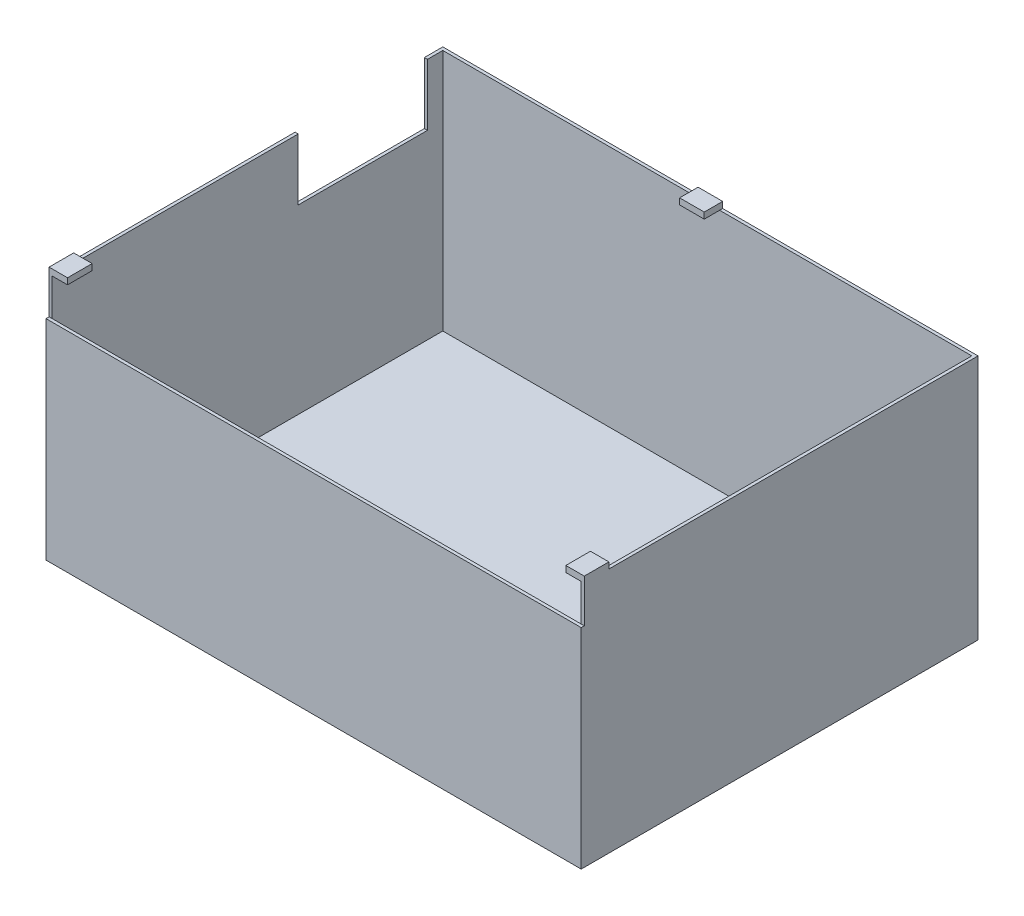
ISO-10303-21;
HEADER;
FILE_DESCRIPTION(('STEP AP214'),'2;1');
FILE_NAME('part.step','',(''),(''),'','','');
FILE_SCHEMA(('AUTOMOTIVE_DESIGN { 1 0 10303 214 1 1 1 1 }'));
ENDSEC;
DATA;
#1=APPLICATION_CONTEXT('core data for automotive mechanical design processes');
#2=APPLICATION_PROTOCOL_DEFINITION('international standard','automotive_design',2000,#1);
#3=PRODUCT_CONTEXT('',#1,'mechanical');
#4=PRODUCT('Part','Part','',(#3));
#5=PRODUCT_RELATED_PRODUCT_CATEGORY('part','',(#4));
#6=PRODUCT_DEFINITION_FORMATION('','',#4);
#7=PRODUCT_DEFINITION_CONTEXT('part definition',#1,'design');
#8=PRODUCT_DEFINITION('design','',#6,#7);
#9=PRODUCT_DEFINITION_SHAPE('','',#8);
#10=(LENGTH_UNIT() NAMED_UNIT(*) SI_UNIT(.MILLI.,.METRE.));
#11=(NAMED_UNIT(*) PLANE_ANGLE_UNIT() SI_UNIT($,.RADIAN.));
#12=(NAMED_UNIT(*) SI_UNIT($,.STERADIAN.) SOLID_ANGLE_UNIT());
#13=UNCERTAINTY_MEASURE_WITH_UNIT(LENGTH_MEASURE(1.E-05),#10,'distance_accuracy_value','');
#14=(GEOMETRIC_REPRESENTATION_CONTEXT(3) GLOBAL_UNCERTAINTY_ASSIGNED_CONTEXT((#13)) GLOBAL_UNIT_ASSIGNED_CONTEXT((#10,
#11,#12)) REPRESENTATION_CONTEXT('',''));
#15=CARTESIAN_POINT('',(0.,0.,0.));
#16=DIRECTION('',(0.,0.,1.));
#17=DIRECTION('',(1.,0.,0.));
#18=AXIS2_PLACEMENT_3D('',#15,#16,#17);
#19=CARTESIAN_POINT('',(0.,80.,0.));
#20=DIRECTION('',(0.,1.,0.));
#21=DIRECTION('',(0.,0.,1.));
#22=AXIS2_PLACEMENT_3D('',#19,#20,#21);
#23=PLANE('',#22);
#24=DIRECTION('',(-1.,0.,0.));
#25=VECTOR('',#24,1.);
#26=CARTESIAN_POINT('',(9.,80.,-122.));
#27=LINE('',#26,#25);
#28=CARTESIAN_POINT('',(0.,80.,-122.));
#29=VERTEX_POINT('',#28);
#30=CARTESIAN_POINT('',(-1.,80.,-122.));
#31=VERTEX_POINT('',#30);
#32=EDGE_CURVE('E236',#29,#31,#27,.T.);
#33=ORIENTED_EDGE('',*,*,#32,.F.);
#34=DIRECTION('',(0.,0.,-1.));
#35=VECTOR('',#34,1.);
#36=CARTESIAN_POINT('',(0.,80.,0.));
#37=LINE('',#36,#35);
#38=CARTESIAN_POINT('',(0.,80.,-127.));
#39=VERTEX_POINT('',#38);
#40=EDGE_CURVE('E369',#29,#39,#37,.T.);
#41=ORIENTED_EDGE('',*,*,#40,.T.);
#42=DIRECTION('',(1.,0.,0.));
#43=VECTOR('',#42,1.);
#44=CARTESIAN_POINT('',(0.,80.,-127.));
#45=LINE('',#44,#43);
#46=CARTESIAN_POINT('',(82.,80.,-127.));
#47=VERTEX_POINT('',#46);
#48=EDGE_CURVE('E375',#39,#47,#45,.T.);
#49=ORIENTED_EDGE('',*,*,#48,.T.);
#50=DIRECTION('',(0.,0.,1.));
#51=VECTOR('',#50,1.);
#52=CARTESIAN_POINT('',(82.,80.,-128.));
#53=LINE('',#52,#51);
#54=CARTESIAN_POINT('',(82.,80.,-128.));
#55=VERTEX_POINT('',#54);
#56=EDGE_CURVE('E270',#55,#47,#53,.T.);
#57=ORIENTED_EDGE('',*,*,#56,.F.);
#58=DIRECTION('',(1.,0.,0.));
#59=VECTOR('',#58,1.);
#60=CARTESIAN_POINT('',(0.,80.,-128.));
#61=LINE('',#60,#59);
#62=CARTESIAN_POINT('',(-1.,80.,-128.));
#63=VERTEX_POINT('',#62);
#64=EDGE_CURVE('E363',#63,#55,#61,.T.);
#65=ORIENTED_EDGE('',*,*,#64,.F.);
#66=DIRECTION('',(0.,0.,-1.));
#67=VECTOR('',#66,1.);
#68=CARTESIAN_POINT('',(-1.,80.,0.));
#69=LINE('',#68,#67);
#70=EDGE_CURVE('E366',#31,#63,#69,.T.);
#71=ORIENTED_EDGE('',*,*,#70,.F.);
#72=EDGE_LOOP('',(#33,#41,#49,#57,#65,#71));
#73=FACE_BOUND('',#72,.T.);
#74=ADVANCED_FACE('F43',(#73),#23,.T.);
#75=DIRECTION('',(-1.,0.,0.));
#76=VECTOR('',#75,1.);
#77=CARTESIAN_POINT('',(9.,80.,-80.));
#78=LINE('',#77,#76);
#79=CARTESIAN_POINT('',(0.,80.,-80.));
#80=VERTEX_POINT('',#79);
#81=CARTESIAN_POINT('',(-1.,80.,-80.));
#82=VERTEX_POINT('',#81);
#83=EDGE_CURVE('E247',#80,#82,#78,.T.);
#84=ORIENTED_EDGE('',*,*,#83,.T.);
#85=CARTESIAN_POINT('',(-1.,80.,-8.));
#86=VERTEX_POINT('',#85);
#87=EDGE_CURVE('E367',#86,#82,#69,.T.);
#88=ORIENTED_EDGE('',*,*,#87,.F.);
#89=DIRECTION('',(-1.,0.,0.));
#90=VECTOR('',#89,1.);
#91=CARTESIAN_POINT('',(-1.,80.,-8.));
#92=LINE('',#91,#90);
#93=CARTESIAN_POINT('',(0.,80.,-8.));
#94=VERTEX_POINT('',#93);
#95=EDGE_CURVE('E326',#94,#86,#92,.T.);
#96=ORIENTED_EDGE('',*,*,#95,.F.);
#97=EDGE_CURVE('E374',#94,#80,#37,.T.);
#98=ORIENTED_EDGE('',*,*,#97,.T.);
#99=EDGE_LOOP('',(#84,#88,#96,#98));
#100=FACE_BOUND('',#99,.T.);
#101=ADVANCED_FACE('F430',(#100),#23,.T.);
#102=CARTESIAN_POINT('',(90.,80.,-128.));
#103=VERTEX_POINT('',#102);
#104=CARTESIAN_POINT('',(173.,80.,-128.));
#105=VERTEX_POINT('',#104);
#106=EDGE_CURVE('E66',#103,#105,#61,.T.);
#107=ORIENTED_EDGE('',*,*,#106,.F.);
#108=DIRECTION('',(0.,0.,-1.));
#109=VECTOR('',#108,1.);
#110=CARTESIAN_POINT('',(90.,80.,-128.));
#111=LINE('',#110,#109);
#112=CARTESIAN_POINT('',(90.,80.,-127.));
#113=VERTEX_POINT('',#112);
#114=EDGE_CURVE('E267',#113,#103,#111,.T.);
#115=ORIENTED_EDGE('',*,*,#114,.F.);
#116=CARTESIAN_POINT('',(172.,80.,-127.));
#117=VERTEX_POINT('',#116);
#118=EDGE_CURVE('E373',#113,#117,#45,.T.);
#119=ORIENTED_EDGE('',*,*,#118,.T.);
#120=DIRECTION('',(0.,0.,-1.));
#121=VECTOR('',#120,1.);
#122=CARTESIAN_POINT('',(172.,80.,0.));
#123=LINE('',#122,#121);
#124=CARTESIAN_POINT('',(172.,80.,-8.));
#125=VERTEX_POINT('',#124);
#126=EDGE_CURVE('E361',#125,#117,#123,.T.);
#127=ORIENTED_EDGE('',*,*,#126,.F.);
#128=DIRECTION('',(-1.,0.,0.));
#129=VECTOR('',#128,1.);
#130=CARTESIAN_POINT('',(173.,80.,-8.));
#131=LINE('',#130,#129);
#132=CARTESIAN_POINT('',(173.,80.,-8.));
#133=VERTEX_POINT('',#132);
#134=EDGE_CURVE('E298',#133,#125,#131,.T.);
#135=ORIENTED_EDGE('',*,*,#134,.F.);
#136=DIRECTION('',(0.,0.,-1.));
#137=VECTOR('',#136,1.);
#138=CARTESIAN_POINT('',(173.,80.,0.));
#139=LINE('',#138,#137);
#140=EDGE_CURVE('E360',#133,#105,#139,.T.);
#141=ORIENTED_EDGE('',*,*,#140,.T.);
#142=EDGE_LOOP('',(#107,#115,#119,#127,#135,#141));
#143=FACE_BOUND('',#142,.T.);
#144=ADVANCED_FACE('F446',(#143),#23,.T.);
#145=CARTESIAN_POINT('',(0.,1.,0.));
#146=DIRECTION('',(0.,0.,-1.));
#147=DIRECTION('',(-1.,0.,0.));
#148=AXIS2_PLACEMENT_3D('',#145,#146,#147);
#149=PLANE('',#148);
#150=DIRECTION('',(0.,-1.,0.));
#151=VECTOR('',#150,1.);
#152=CARTESIAN_POINT('',(-1.,80.,0.));
#153=LINE('',#152,#151);
#154=CARTESIAN_POINT('',(-1.,82.,0.));
#155=VERTEX_POINT('',#154);
#156=CARTESIAN_POINT('',(-1.,68.,0.));
#157=VERTEX_POINT('',#156);
#158=EDGE_CURVE('E397',#155,#157,#153,.T.);
#159=ORIENTED_EDGE('',*,*,#158,.T.);
#160=DIRECTION('',(1.,0.,0.));
#161=VECTOR('',#160,1.);
#162=CARTESIAN_POINT('',(0.,68.,0.));
#163=LINE('',#162,#161);
#164=CARTESIAN_POINT('',(0.,68.,0.));
#165=VERTEX_POINT('',#164);
#166=EDGE_CURVE('E336',#157,#165,#163,.T.);
#167=ORIENTED_EDGE('',*,*,#166,.T.);
#168=DIRECTION('',(0.,-1.,0.));
#169=VECTOR('',#168,1.);
#170=CARTESIAN_POINT('',(0.,80.,0.));
#171=LINE('',#170,#169);
#172=CARTESIAN_POINT('',(0.,80.,0.));
#173=VERTEX_POINT('',#172);
#174=EDGE_CURVE('E394',#173,#165,#171,.T.);
#175=ORIENTED_EDGE('',*,*,#174,.F.);
#176=DIRECTION('',(1.,0.,0.));
#177=VECTOR('',#176,1.);
#178=CARTESIAN_POINT('',(-1.,80.,0.));
#179=LINE('',#178,#177);
#180=CARTESIAN_POINT('',(5.,80.,0.));
#181=VERTEX_POINT('',#180);
#182=EDGE_CURVE('E301',#173,#181,#179,.T.);
#183=ORIENTED_EDGE('',*,*,#182,.T.);
#184=DIRECTION('',(0.,-1.,0.));
#185=VECTOR('',#184,1.);
#186=CARTESIAN_POINT('',(5.,82.,0.));
#187=LINE('',#186,#185);
#188=CARTESIAN_POINT('',(5.,82.,0.));
#189=VERTEX_POINT('',#188);
#190=EDGE_CURVE('E332',#189,#181,#187,.T.);
#191=ORIENTED_EDGE('',*,*,#190,.F.);
#192=DIRECTION('',(1.,0.,0.));
#193=VECTOR('',#192,1.);
#194=CARTESIAN_POINT('',(-1.,82.,0.));
#195=LINE('',#194,#193);
#196=EDGE_CURVE('E313',#155,#189,#195,.T.);
#197=ORIENTED_EDGE('',*,*,#196,.F.);
#198=EDGE_LOOP('',(#159,#167,#175,#183,#191,#197));
#199=FACE_BOUND('',#198,.T.);
#200=ADVANCED_FACE('F519',(#199),#149,.F.);
#201=DIRECTION('',(0.,-1.,0.));
#202=VECTOR('',#201,1.);
#203=CARTESIAN_POINT('',(172.,80.,0.));
#204=LINE('',#203,#202);
#205=CARTESIAN_POINT('',(172.,80.,0.));
#206=VERTEX_POINT('',#205);
#207=CARTESIAN_POINT('',(172.,68.,0.));
#208=VERTEX_POINT('',#207);
#209=EDGE_CURVE('E408',#206,#208,#204,.T.);
#210=ORIENTED_EDGE('',*,*,#209,.T.);
#211=CARTESIAN_POINT('',(173.,68.,0.));
#212=VERTEX_POINT('',#211);
#213=EDGE_CURVE('E341',#208,#212,#163,.T.);
#214=ORIENTED_EDGE('',*,*,#213,.T.);
#215=DIRECTION('',(0.,-1.,0.));
#216=VECTOR('',#215,1.);
#217=CARTESIAN_POINT('',(173.,80.,0.));
#218=LINE('',#217,#216);
#219=CARTESIAN_POINT('',(173.,82.,0.));
#220=VERTEX_POINT('',#219);
#221=EDGE_CURVE('E404',#220,#212,#218,.T.);
#222=ORIENTED_EDGE('',*,*,#221,.F.);
#223=DIRECTION('',(1.,0.,0.));
#224=VECTOR('',#223,1.);
#225=CARTESIAN_POINT('',(173.,82.,0.));
#226=LINE('',#225,#224);
#227=CARTESIAN_POINT('',(167.,82.,0.));
#228=VERTEX_POINT('',#227);
#229=EDGE_CURVE('E290',#228,#220,#226,.T.);
#230=ORIENTED_EDGE('',*,*,#229,.F.);
#231=DIRECTION('',(0.,-1.,0.));
#232=VECTOR('',#231,1.);
#233=CARTESIAN_POINT('',(167.,82.,0.));
#234=LINE('',#233,#232);
#235=CARTESIAN_POINT('',(167.,80.,0.));
#236=VERTEX_POINT('',#235);
#237=EDGE_CURVE('E287',#228,#236,#234,.T.);
#238=ORIENTED_EDGE('',*,*,#237,.T.);
#239=DIRECTION('',(1.,0.,0.));
#240=VECTOR('',#239,1.);
#241=CARTESIAN_POINT('',(173.,80.,0.));
#242=LINE('',#241,#240);
#243=EDGE_CURVE('E291',#236,#206,#242,.T.);
#244=ORIENTED_EDGE('',*,*,#243,.T.);
#245=EDGE_LOOP('',(#210,#214,#222,#230,#238,#244));
#246=FACE_BOUND('',#245,.T.);
#247=ADVANCED_FACE('F45',(#246),#149,.F.);
#248=CARTESIAN_POINT('',(0.,1.,0.));
#249=DIRECTION('',(0.,1.,0.));
#250=DIRECTION('',(0.,0.,1.));
#251=AXIS2_PLACEMENT_3D('',#248,#249,#250);
#252=PLANE('',#251);
#253=DIRECTION('',(1.,0.,0.));
#254=VECTOR('',#253,1.);
#255=CARTESIAN_POINT('',(0.,1.,0.));
#256=LINE('',#255,#254);
#257=CARTESIAN_POINT('',(0.,1.,0.));
#258=VERTEX_POINT('',#257);
#259=CARTESIAN_POINT('',(172.,1.,0.));
#260=VERTEX_POINT('',#259);
#261=EDGE_CURVE('E411',#258,#260,#256,.T.);
#262=ORIENTED_EDGE('',*,*,#261,.T.);
#263=DIRECTION('',(0.,0.,-1.));
#264=VECTOR('',#263,1.);
#265=CARTESIAN_POINT('',(172.,1.,0.));
#266=LINE('',#265,#264);
#267=CARTESIAN_POINT('',(172.,1.,-127.));
#268=VERTEX_POINT('',#267);
#269=EDGE_CURVE('E414',#260,#268,#266,.T.);
#270=ORIENTED_EDGE('',*,*,#269,.T.);
#271=DIRECTION('',(1.,0.,0.));
#272=VECTOR('',#271,1.);
#273=CARTESIAN_POINT('',(0.,1.,-127.));
#274=LINE('',#273,#272);
#275=CARTESIAN_POINT('',(0.,1.,-127.));
#276=VERTEX_POINT('',#275);
#277=EDGE_CURVE('E417',#276,#268,#274,.T.);
#278=ORIENTED_EDGE('',*,*,#277,.F.);
#279=DIRECTION('',(0.,0.,-1.));
#280=VECTOR('',#279,1.);
#281=CARTESIAN_POINT('',(0.,1.,0.));
#282=LINE('',#281,#280);
#283=EDGE_CURVE('E419',#258,#276,#282,.T.);
#284=ORIENTED_EDGE('',*,*,#283,.F.);
#285=EDGE_LOOP('',(#262,#270,#278,#284));
#286=FACE_BOUND('',#285,.T.);
#287=ADVANCED_FACE('F453',(#286),#252,.T.);
#288=CARTESIAN_POINT('',(0.,0.,0.));
#289=DIRECTION('',(0.,1.,0.));
#290=DIRECTION('',(0.,0.,1.));
#291=AXIS2_PLACEMENT_3D('',#288,#289,#290);
#292=PLANE('',#291);
#293=DIRECTION('',(0.,0.,-1.));
#294=VECTOR('',#293,1.);
#295=CARTESIAN_POINT('',(173.,0.,0.));
#296=LINE('',#295,#294);
#297=CARTESIAN_POINT('',(173.,0.,1.));
#298=VERTEX_POINT('',#297);
#299=CARTESIAN_POINT('',(173.,0.,-128.));
#300=VERTEX_POINT('',#299);
#301=EDGE_CURVE('E356',#298,#300,#296,.T.);
#302=ORIENTED_EDGE('',*,*,#301,.F.);
#303=DIRECTION('',(1.,0.,0.));
#304=VECTOR('',#303,1.);
#305=CARTESIAN_POINT('',(0.,0.,1.));
#306=LINE('',#305,#304);
#307=CARTESIAN_POINT('',(-1.,0.,1.));
#308=VERTEX_POINT('',#307);
#309=EDGE_CURVE('E335',#308,#298,#306,.T.);
#310=ORIENTED_EDGE('',*,*,#309,.F.);
#311=DIRECTION('',(0.,0.,-1.));
#312=VECTOR('',#311,1.);
#313=CARTESIAN_POINT('',(-1.,0.,0.));
#314=LINE('',#313,#312);
#315=CARTESIAN_POINT('',(-1.,0.,-128.));
#316=VERTEX_POINT('',#315);
#317=EDGE_CURVE('E385',#308,#316,#314,.T.);
#318=ORIENTED_EDGE('',*,*,#317,.T.);
#319=DIRECTION('',(1.,0.,0.));
#320=VECTOR('',#319,1.);
#321=CARTESIAN_POINT('',(0.,0.,-128.));
#322=LINE('',#321,#320);
#323=EDGE_CURVE('E382',#316,#300,#322,.T.);
#324=ORIENTED_EDGE('',*,*,#323,.T.);
#325=EDGE_LOOP('',(#302,#310,#318,#324));
#326=FACE_BOUND('',#325,.T.);
#327=ADVANCED_FACE('F501',(#326),#292,.F.);
#328=CARTESIAN_POINT('',(172.,80.,0.));
#329=DIRECTION('',(-1.,0.,0.));
#330=DIRECTION('',(0.,0.,1.));
#331=AXIS2_PLACEMENT_3D('',#328,#329,#330);
#332=PLANE('',#331);
#333=DIRECTION('',(0.,-1.,0.));
#334=VECTOR('',#333,1.);
#335=CARTESIAN_POINT('',(172.,80.,-127.));
#336=LINE('',#335,#334);
#337=EDGE_CURVE('E378',#117,#268,#336,.T.);
#338=ORIENTED_EDGE('',*,*,#337,.T.);
#339=ORIENTED_EDGE('',*,*,#269,.F.);
#340=EDGE_CURVE('E407',#208,#260,#204,.T.);
#341=ORIENTED_EDGE('',*,*,#340,.F.);
#342=ORIENTED_EDGE('',*,*,#209,.F.);
#343=EDGE_CURVE('E357',#206,#125,#123,.T.);
#344=ORIENTED_EDGE('',*,*,#343,.T.);
#345=ORIENTED_EDGE('',*,*,#126,.T.);
#346=EDGE_LOOP('',(#338,#339,#341,#342,#344,#345));
#347=FACE_BOUND('',#346,.T.);
#348=ADVANCED_FACE('F448',(#347),#332,.T.);
#349=CARTESIAN_POINT('',(173.,80.,0.));
#350=DIRECTION('',(-1.,0.,0.));
#351=DIRECTION('',(0.,0.,1.));
#352=AXIS2_PLACEMENT_3D('',#349,#350,#351);
#353=PLANE('',#352);
#354=ORIENTED_EDGE('',*,*,#301,.T.);
#355=DIRECTION('',(0.,-1.,0.));
#356=VECTOR('',#355,1.);
#357=CARTESIAN_POINT('',(173.,80.,-128.));
#358=LINE('',#357,#356);
#359=EDGE_CURVE('E402',#105,#300,#358,.T.);
#360=ORIENTED_EDGE('',*,*,#359,.F.);
#361=ORIENTED_EDGE('',*,*,#140,.F.);
#362=DIRECTION('',(0.,-1.,0.));
#363=VECTOR('',#362,1.);
#364=CARTESIAN_POINT('',(173.,82.,-8.));
#365=LINE('',#364,#363);
#366=CARTESIAN_POINT('',(173.,82.,-8.));
#367=VERTEX_POINT('',#366);
#368=EDGE_CURVE('E273',#367,#133,#365,.T.);
#369=ORIENTED_EDGE('',*,*,#368,.F.);
#370=DIRECTION('',(0.,0.,-1.));
#371=VECTOR('',#370,1.);
#372=CARTESIAN_POINT('',(173.,82.,0.));
#373=LINE('',#372,#371);
#374=EDGE_CURVE('E295',#220,#367,#373,.T.);
#375=ORIENTED_EDGE('',*,*,#374,.F.);
#376=ORIENTED_EDGE('',*,*,#221,.T.);
#377=DIRECTION('',(0.,0.,-1.));
#378=VECTOR('',#377,1.);
#379=CARTESIAN_POINT('',(173.,68.,0.));
#380=LINE('',#379,#378);
#381=CARTESIAN_POINT('',(173.,68.,1.));
#382=VERTEX_POINT('',#381);
#383=EDGE_CURVE('E346',#382,#212,#380,.T.);
#384=ORIENTED_EDGE('',*,*,#383,.F.);
#385=DIRECTION('',(0.,-1.,0.));
#386=VECTOR('',#385,1.);
#387=CARTESIAN_POINT('',(173.,68.,1.));
#388=LINE('',#387,#386);
#389=EDGE_CURVE('E348',#382,#298,#388,.T.);
#390=ORIENTED_EDGE('',*,*,#389,.T.);
#391=EDGE_LOOP('',(#354,#360,#361,#369,#375,#376,#384,#390));
#392=FACE_BOUND('',#391,.T.);
#393=ADVANCED_FACE('F472',(#392),#353,.F.);
#394=CARTESIAN_POINT('',(0.,80.,-128.));
#395=DIRECTION('',(0.,0.,-1.));
#396=DIRECTION('',(-1.,0.,0.));
#397=AXIS2_PLACEMENT_3D('',#394,#395,#396);
#398=PLANE('',#397);
#399=ORIENTED_EDGE('',*,*,#323,.F.);
#400=DIRECTION('',(0.,-1.,0.));
#401=VECTOR('',#400,1.);
#402=CARTESIAN_POINT('',(-1.,80.,-128.));
#403=LINE('',#402,#401);
#404=EDGE_CURVE('E400',#63,#316,#403,.T.);
#405=ORIENTED_EDGE('',*,*,#404,.F.);
#406=ORIENTED_EDGE('',*,*,#64,.T.);
#407=DIRECTION('',(0.,-1.,0.));
#408=VECTOR('',#407,1.);
#409=CARTESIAN_POINT('',(82.,82.,-128.));
#410=LINE('',#409,#408);
#411=CARTESIAN_POINT('',(82.,82.,-128.));
#412=VERTEX_POINT('',#411);
#413=EDGE_CURVE('E259',#412,#55,#410,.T.);
#414=ORIENTED_EDGE('',*,*,#413,.F.);
#415=DIRECTION('',(-1.,0.,0.));
#416=VECTOR('',#415,1.);
#417=CARTESIAN_POINT('',(82.,82.,-128.));
#418=LINE('',#417,#416);
#419=CARTESIAN_POINT('',(90.,82.,-128.));
#420=VERTEX_POINT('',#419);
#421=EDGE_CURVE('E262',#420,#412,#418,.T.);
#422=ORIENTED_EDGE('',*,*,#421,.F.);
#423=DIRECTION('',(0.,-1.,0.));
#424=VECTOR('',#423,1.);
#425=CARTESIAN_POINT('',(90.,82.,-128.));
#426=LINE('',#425,#424);
#427=EDGE_CURVE('E256',#420,#103,#426,.T.);
#428=ORIENTED_EDGE('',*,*,#427,.T.);
#429=ORIENTED_EDGE('',*,*,#106,.T.);
#430=ORIENTED_EDGE('',*,*,#359,.T.);
#431=EDGE_LOOP('',(#399,#405,#406,#414,#422,#428,#429,#430));
#432=FACE_BOUND('',#431,.T.);
#433=ADVANCED_FACE('F476',(#432),#398,.T.);
#434=CARTESIAN_POINT('',(-1.,80.,0.));
#435=DIRECTION('',(-1.,0.,0.));
#436=DIRECTION('',(0.,0.,1.));
#437=AXIS2_PLACEMENT_3D('',#434,#435,#436);
#438=PLANE('',#437);
#439=DIRECTION('',(0.,-1.,0.));
#440=VECTOR('',#439,1.);
#441=CARTESIAN_POINT('',(-1.,80.,-122.));
#442=LINE('',#441,#440);
#443=CARTESIAN_POINT('',(-1.,60.,-122.));
#444=VERTEX_POINT('',#443);
#445=EDGE_CURVE('E233',#31,#444,#442,.T.);
#446=ORIENTED_EDGE('',*,*,#445,.F.);
#447=ORIENTED_EDGE('',*,*,#70,.T.);
#448=ORIENTED_EDGE('',*,*,#404,.T.);
#449=ORIENTED_EDGE('',*,*,#317,.F.);
#450=DIRECTION('',(0.,-1.,0.));
#451=VECTOR('',#450,1.);
#452=CARTESIAN_POINT('',(-1.,68.,1.));
#453=LINE('',#452,#451);
#454=CARTESIAN_POINT('',(-1.,68.,1.));
#455=VERTEX_POINT('',#454);
#456=EDGE_CURVE('E353',#455,#308,#453,.T.);
#457=ORIENTED_EDGE('',*,*,#456,.F.);
#458=DIRECTION('',(0.,0.,-1.));
#459=VECTOR('',#458,1.);
#460=CARTESIAN_POINT('',(-1.,68.,0.));
#461=LINE('',#460,#459);
#462=EDGE_CURVE('E339',#455,#157,#461,.T.);
#463=ORIENTED_EDGE('',*,*,#462,.T.);
#464=ORIENTED_EDGE('',*,*,#158,.F.);
#465=DIRECTION('',(0.,0.,1.));
#466=VECTOR('',#465,1.);
#467=CARTESIAN_POINT('',(-1.,82.,0.));
#468=LINE('',#467,#466);
#469=CARTESIAN_POINT('',(-1.,82.,-8.));
#470=VERTEX_POINT('',#469);
#471=EDGE_CURVE('E310',#470,#155,#468,.T.);
#472=ORIENTED_EDGE('',*,*,#471,.F.);
#473=DIRECTION('',(0.,-1.,0.));
#474=VECTOR('',#473,1.);
#475=CARTESIAN_POINT('',(-1.,82.,-8.));
#476=LINE('',#475,#474);
#477=EDGE_CURVE('E320',#470,#86,#476,.T.);
#478=ORIENTED_EDGE('',*,*,#477,.T.);
#479=ORIENTED_EDGE('',*,*,#87,.T.);
#480=DIRECTION('',(0.,1.,0.));
#481=VECTOR('',#480,1.);
#482=CARTESIAN_POINT('',(-1.,80.,-80.));
#483=LINE('',#482,#481);
#484=CARTESIAN_POINT('',(-1.,60.,-80.));
#485=VERTEX_POINT('',#484);
#486=EDGE_CURVE('E230',#485,#82,#483,.T.);
#487=ORIENTED_EDGE('',*,*,#486,.F.);
#488=DIRECTION('',(0.,0.,1.));
#489=VECTOR('',#488,1.);
#490=CARTESIAN_POINT('',(-1.,60.,-122.));
#491=LINE('',#490,#489);
#492=EDGE_CURVE('E225',#444,#485,#491,.T.);
#493=ORIENTED_EDGE('',*,*,#492,.F.);
#494=EDGE_LOOP('',(#446,#447,#448,#449,#457,#463,#464,#472,#478,#479,#487,#493));
#495=FACE_BOUND('',#494,.T.);
#496=ADVANCED_FACE('F240',(#495),#438,.T.);
#497=CARTESIAN_POINT('',(0.,80.,0.));
#498=DIRECTION('',(-1.,0.,0.));
#499=DIRECTION('',(0.,0.,1.));
#500=AXIS2_PLACEMENT_3D('',#497,#498,#499);
#501=PLANE('',#500);
#502=ORIENTED_EDGE('',*,*,#40,.F.);
#503=DIRECTION('',(0.,-1.,0.));
#504=VECTOR('',#503,1.);
#505=CARTESIAN_POINT('',(0.,80.,-122.));
#506=LINE('',#505,#504);
#507=CARTESIAN_POINT('',(0.,60.,-122.));
#508=VERTEX_POINT('',#507);
#509=EDGE_CURVE('E11',#29,#508,#506,.T.);
#510=ORIENTED_EDGE('',*,*,#509,.T.);
#511=DIRECTION('',(0.,0.,1.));
#512=VECTOR('',#511,1.);
#513=CARTESIAN_POINT('',(0.,60.,0.));
#514=LINE('',#513,#512);
#515=CARTESIAN_POINT('',(0.,60.,-80.));
#516=VERTEX_POINT('',#515);
#517=EDGE_CURVE('E228',#508,#516,#514,.T.);
#518=ORIENTED_EDGE('',*,*,#517,.T.);
#519=DIRECTION('',(0.,1.,0.));
#520=VECTOR('',#519,1.);
#521=CARTESIAN_POINT('',(0.,80.,-80.));
#522=LINE('',#521,#520);
#523=EDGE_CURVE('E51',#516,#80,#522,.T.);
#524=ORIENTED_EDGE('',*,*,#523,.T.);
#525=ORIENTED_EDGE('',*,*,#97,.F.);
#526=EDGE_CURVE('E370',#173,#94,#37,.T.);
#527=ORIENTED_EDGE('',*,*,#526,.F.);
#528=ORIENTED_EDGE('',*,*,#174,.T.);
#529=EDGE_CURVE('E393',#165,#258,#171,.T.);
#530=ORIENTED_EDGE('',*,*,#529,.T.);
#531=ORIENTED_EDGE('',*,*,#283,.T.);
#532=DIRECTION('',(0.,-1.,0.));
#533=VECTOR('',#532,1.);
#534=CARTESIAN_POINT('',(0.,80.,-127.));
#535=LINE('',#534,#533);
#536=EDGE_CURVE('E390',#39,#276,#535,.T.);
#537=ORIENTED_EDGE('',*,*,#536,.F.);
#538=EDGE_LOOP('',(#502,#510,#518,#524,#525,#527,#528,#530,#531,#537));
#539=FACE_BOUND('',#538,.T.);
#540=ADVANCED_FACE('F426',(#539),#501,.F.);
#541=CARTESIAN_POINT('',(0.,80.,-127.));
#542=DIRECTION('',(0.,0.,-1.));
#543=DIRECTION('',(-1.,0.,0.));
#544=AXIS2_PLACEMENT_3D('',#541,#542,#543);
#545=PLANE('',#544);
#546=ORIENTED_EDGE('',*,*,#277,.T.);
#547=ORIENTED_EDGE('',*,*,#337,.F.);
#548=ORIENTED_EDGE('',*,*,#118,.F.);
#549=EDGE_CURVE('E379',#47,#113,#45,.T.);
#550=ORIENTED_EDGE('',*,*,#549,.F.);
#551=ORIENTED_EDGE('',*,*,#48,.F.);
#552=ORIENTED_EDGE('',*,*,#536,.T.);
#553=EDGE_LOOP('',(#546,#547,#548,#550,#551,#552));
#554=FACE_BOUND('',#553,.T.);
#555=ADVANCED_FACE('F440',(#554),#545,.F.);
#556=CARTESIAN_POINT('',(0.,68.,0.));
#557=DIRECTION('',(0.,0.,-1.));
#558=DIRECTION('',(-1.,0.,0.));
#559=AXIS2_PLACEMENT_3D('',#556,#557,#558);
#560=PLANE('',#559);
#561=EDGE_CURVE('E340',#165,#208,#163,.T.);
#562=ORIENTED_EDGE('',*,*,#561,.T.);
#563=ORIENTED_EDGE('',*,*,#340,.T.);
#564=ORIENTED_EDGE('',*,*,#261,.F.);
#565=ORIENTED_EDGE('',*,*,#529,.F.);
#566=EDGE_LOOP('',(#562,#563,#564,#565));
#567=FACE_BOUND('',#566,.T.);
#568=ADVANCED_FACE('F565',(#567),#560,.T.);
#569=CARTESIAN_POINT('',(0.,68.,1.));
#570=DIRECTION('',(0.,0.,-1.));
#571=DIRECTION('',(-1.,0.,0.));
#572=AXIS2_PLACEMENT_3D('',#569,#570,#571);
#573=PLANE('',#572);
#574=ORIENTED_EDGE('',*,*,#309,.T.);
#575=ORIENTED_EDGE('',*,*,#389,.F.);
#576=DIRECTION('',(1.,0.,0.));
#577=VECTOR('',#576,1.);
#578=CARTESIAN_POINT('',(0.,68.,1.));
#579=LINE('',#578,#577);
#580=EDGE_CURVE('E344',#455,#382,#579,.T.);
#581=ORIENTED_EDGE('',*,*,#580,.F.);
#582=ORIENTED_EDGE('',*,*,#456,.T.);
#583=EDGE_LOOP('',(#574,#575,#581,#582));
#584=FACE_BOUND('',#583,.T.);
#585=ADVANCED_FACE('F498',(#584),#573,.F.);
#586=CARTESIAN_POINT('',(0.,68.,0.));
#587=DIRECTION('',(0.,1.,0.));
#588=DIRECTION('',(0.,0.,1.));
#589=AXIS2_PLACEMENT_3D('',#586,#587,#588);
#590=PLANE('',#589);
#591=ORIENTED_EDGE('',*,*,#166,.F.);
#592=ORIENTED_EDGE('',*,*,#462,.F.);
#593=ORIENTED_EDGE('',*,*,#580,.T.);
#594=ORIENTED_EDGE('',*,*,#383,.T.);
#595=ORIENTED_EDGE('',*,*,#213,.F.);
#596=ORIENTED_EDGE('',*,*,#561,.F.);
#597=EDGE_LOOP('',(#591,#592,#593,#594,#595,#596));
#598=FACE_BOUND('',#597,.T.);
#599=ADVANCED_FACE('F532',(#598),#590,.T.);
#600=CARTESIAN_POINT('',(5.,82.,0.));
#601=DIRECTION('',(-1.,0.,0.));
#602=DIRECTION('',(0.,0.,1.));
#603=AXIS2_PLACEMENT_3D('',#600,#601,#602);
#604=PLANE('',#603);
#605=DIRECTION('',(0.,0.,-1.));
#606=VECTOR('',#605,1.);
#607=CARTESIAN_POINT('',(5.,80.,0.));
#608=LINE('',#607,#606);
#609=CARTESIAN_POINT('',(5.,80.,-8.));
#610=VERTEX_POINT('',#609);
#611=EDGE_CURVE('E322',#181,#610,#608,.T.);
#612=ORIENTED_EDGE('',*,*,#611,.T.);
#613=DIRECTION('',(0.,-1.,0.));
#614=VECTOR('',#613,1.);
#615=CARTESIAN_POINT('',(5.,82.,-8.));
#616=LINE('',#615,#614);
#617=CARTESIAN_POINT('',(5.,82.,-8.));
#618=VERTEX_POINT('',#617);
#619=EDGE_CURVE('E329',#618,#610,#616,.T.);
#620=ORIENTED_EDGE('',*,*,#619,.F.);
#621=DIRECTION('',(0.,0.,-1.));
#622=VECTOR('',#621,1.);
#623=CARTESIAN_POINT('',(5.,82.,0.));
#624=LINE('',#623,#622);
#625=EDGE_CURVE('E316',#189,#618,#624,.T.);
#626=ORIENTED_EDGE('',*,*,#625,.F.);
#627=ORIENTED_EDGE('',*,*,#190,.T.);
#628=EDGE_LOOP('',(#612,#620,#626,#627));
#629=FACE_BOUND('',#628,.T.);
#630=ADVANCED_FACE('F546',(#629),#604,.F.);
#631=CARTESIAN_POINT('',(-1.,82.,-8.));
#632=DIRECTION('',(0.,0.,1.));
#633=DIRECTION('',(1.,0.,0.));
#634=AXIS2_PLACEMENT_3D('',#631,#632,#633);
#635=PLANE('',#634);
#636=EDGE_CURVE('E314',#610,#94,#92,.T.);
#637=ORIENTED_EDGE('',*,*,#636,.T.);
#638=ORIENTED_EDGE('',*,*,#95,.T.);
#639=ORIENTED_EDGE('',*,*,#477,.F.);
#640=DIRECTION('',(-1.,0.,0.));
#641=VECTOR('',#640,1.);
#642=CARTESIAN_POINT('',(-1.,82.,-8.));
#643=LINE('',#642,#641);
#644=EDGE_CURVE('E318',#618,#470,#643,.T.);
#645=ORIENTED_EDGE('',*,*,#644,.F.);
#646=ORIENTED_EDGE('',*,*,#619,.T.);
#647=EDGE_LOOP('',(#637,#638,#639,#645,#646));
#648=FACE_BOUND('',#647,.T.);
#649=ADVANCED_FACE('F536',(#648),#635,.F.);
#650=CARTESIAN_POINT('',(0.,82.,0.));
#651=DIRECTION('',(0.,-1.,0.));
#652=DIRECTION('',(0.,0.,-1.));
#653=AXIS2_PLACEMENT_3D('',#650,#651,#652);
#654=PLANE('',#653);
#655=ORIENTED_EDGE('',*,*,#471,.T.);
#656=ORIENTED_EDGE('',*,*,#196,.T.);
#657=ORIENTED_EDGE('',*,*,#625,.T.);
#658=ORIENTED_EDGE('',*,*,#644,.T.);
#659=EDGE_LOOP('',(#655,#656,#657,#658));
#660=FACE_BOUND('',#659,.T.);
#661=ADVANCED_FACE('F548',(#660),#654,.F.);
#662=CARTESIAN_POINT('',(0.,80.,0.));
#663=DIRECTION('',(0.,-1.,0.));
#664=DIRECTION('',(0.,0.,-1.));
#665=AXIS2_PLACEMENT_3D('',#662,#663,#664);
#666=PLANE('',#665);
#667=ORIENTED_EDGE('',*,*,#182,.F.);
#668=ORIENTED_EDGE('',*,*,#526,.T.);
#669=ORIENTED_EDGE('',*,*,#636,.F.);
#670=ORIENTED_EDGE('',*,*,#611,.F.);
#671=EDGE_LOOP('',(#667,#668,#669,#670));
#672=FACE_BOUND('',#671,.T.);
#673=ADVANCED_FACE('F543',(#672),#666,.T.);
#674=CARTESIAN_POINT('',(173.,82.,-8.));
#675=DIRECTION('',(0.,0.,1.));
#676=DIRECTION('',(1.,0.,0.));
#677=AXIS2_PLACEMENT_3D('',#674,#675,#676);
#678=PLANE('',#677);
#679=ORIENTED_EDGE('',*,*,#134,.T.);
#680=CARTESIAN_POINT('',(167.,80.,-8.));
#681=VERTEX_POINT('',#680);
#682=EDGE_CURVE('E297',#125,#681,#131,.T.);
#683=ORIENTED_EDGE('',*,*,#682,.T.);
#684=DIRECTION('',(0.,-1.,0.));
#685=VECTOR('',#684,1.);
#686=CARTESIAN_POINT('',(167.,82.,-8.));
#687=LINE('',#686,#685);
#688=CARTESIAN_POINT('',(167.,82.,-8.));
#689=VERTEX_POINT('',#688);
#690=EDGE_CURVE('E284',#689,#681,#687,.T.);
#691=ORIENTED_EDGE('',*,*,#690,.F.);
#692=DIRECTION('',(-1.,0.,0.));
#693=VECTOR('',#692,1.);
#694=CARTESIAN_POINT('',(173.,82.,-8.));
#695=LINE('',#694,#693);
#696=EDGE_CURVE('E306',#367,#689,#695,.T.);
#697=ORIENTED_EDGE('',*,*,#696,.F.);
#698=ORIENTED_EDGE('',*,*,#368,.T.);
#699=EDGE_LOOP('',(#679,#683,#691,#697,#698));
#700=FACE_BOUND('',#699,.T.);
#701=ADVANCED_FACE('F467',(#700),#678,.F.);
#702=CARTESIAN_POINT('',(167.,82.,0.));
#703=DIRECTION('',(1.,0.,0.));
#704=DIRECTION('',(0.,0.,-1.));
#705=AXIS2_PLACEMENT_3D('',#702,#703,#704);
#706=PLANE('',#705);
#707=DIRECTION('',(0.,0.,1.));
#708=VECTOR('',#707,1.);
#709=CARTESIAN_POINT('',(167.,80.,0.));
#710=LINE('',#709,#708);
#711=EDGE_CURVE('E294',#681,#236,#710,.T.);
#712=ORIENTED_EDGE('',*,*,#711,.T.);
#713=ORIENTED_EDGE('',*,*,#237,.F.);
#714=DIRECTION('',(0.,0.,1.));
#715=VECTOR('',#714,1.);
#716=CARTESIAN_POINT('',(167.,82.,0.));
#717=LINE('',#716,#715);
#718=EDGE_CURVE('E304',#689,#228,#717,.T.);
#719=ORIENTED_EDGE('',*,*,#718,.F.);
#720=ORIENTED_EDGE('',*,*,#690,.T.);
#721=EDGE_LOOP('',(#712,#713,#719,#720));
#722=FACE_BOUND('',#721,.T.);
#723=ADVANCED_FACE('F634',(#722),#706,.F.);
#724=CARTESIAN_POINT('',(0.,82.,0.));
#725=DIRECTION('',(0.,1.,0.));
#726=DIRECTION('',(0.,0.,1.));
#727=AXIS2_PLACEMENT_3D('',#724,#725,#726);
#728=PLANE('',#727);
#729=ORIENTED_EDGE('',*,*,#374,.T.);
#730=ORIENTED_EDGE('',*,*,#696,.T.);
#731=ORIENTED_EDGE('',*,*,#718,.T.);
#732=ORIENTED_EDGE('',*,*,#229,.T.);
#733=EDGE_LOOP('',(#729,#730,#731,#732));
#734=FACE_BOUND('',#733,.T.);
#735=ADVANCED_FACE('F558',(#734),#728,.T.);
#736=CARTESIAN_POINT('',(0.,80.,0.));
#737=DIRECTION('',(0.,1.,0.));
#738=DIRECTION('',(0.,0.,1.));
#739=AXIS2_PLACEMENT_3D('',#736,#737,#738);
#740=PLANE('',#739);
#741=ORIENTED_EDGE('',*,*,#343,.F.);
#742=ORIENTED_EDGE('',*,*,#243,.F.);
#743=ORIENTED_EDGE('',*,*,#711,.F.);
#744=ORIENTED_EDGE('',*,*,#682,.F.);
#745=EDGE_LOOP('',(#741,#742,#743,#744));
#746=FACE_BOUND('',#745,.T.);
#747=ADVANCED_FACE('F464',(#746),#740,.F.);
#748=CARTESIAN_POINT('',(0.,80.,0.));
#749=DIRECTION('',(0.,1.,0.));
#750=DIRECTION('',(0.,0.,1.));
#751=AXIS2_PLACEMENT_3D('',#748,#749,#750);
#752=PLANE('',#751);
#753=CARTESIAN_POINT('',(82.,80.,-122.));
#754=VERTEX_POINT('',#753);
#755=EDGE_CURVE('E269',#47,#754,#53,.T.);
#756=ORIENTED_EDGE('',*,*,#755,.F.);
#757=ORIENTED_EDGE('',*,*,#549,.T.);
#758=CARTESIAN_POINT('',(90.,80.,-122.));
#759=VERTEX_POINT('',#758);
#760=EDGE_CURVE('E263',#759,#113,#111,.T.);
#761=ORIENTED_EDGE('',*,*,#760,.F.);
#762=DIRECTION('',(1.,0.,0.));
#763=VECTOR('',#762,1.);
#764=CARTESIAN_POINT('',(82.,80.,-122.));
#765=LINE('',#764,#763);
#766=EDGE_CURVE('E266',#754,#759,#765,.T.);
#767=ORIENTED_EDGE('',*,*,#766,.F.);
#768=EDGE_LOOP('',(#756,#757,#761,#767));
#769=FACE_BOUND('',#768,.T.);
#770=ADVANCED_FACE('F486',(#769),#752,.F.);
#771=CARTESIAN_POINT('',(82.,82.,-128.));
#772=DIRECTION('',(1.,0.,0.));
#773=DIRECTION('',(0.,0.,-1.));
#774=AXIS2_PLACEMENT_3D('',#771,#772,#773);
#775=PLANE('',#774);
#776=ORIENTED_EDGE('',*,*,#56,.T.);
#777=ORIENTED_EDGE('',*,*,#755,.T.);
#778=DIRECTION('',(0.,-1.,0.));
#779=VECTOR('',#778,1.);
#780=CARTESIAN_POINT('',(82.,82.,-122.));
#781=LINE('',#780,#779);
#782=CARTESIAN_POINT('',(82.,82.,-122.));
#783=VERTEX_POINT('',#782);
#784=EDGE_CURVE('E246',#783,#754,#781,.T.);
#785=ORIENTED_EDGE('',*,*,#784,.F.);
#786=DIRECTION('',(0.,0.,1.));
#787=VECTOR('',#786,1.);
#788=CARTESIAN_POINT('',(82.,82.,-128.));
#789=LINE('',#788,#787);
#790=EDGE_CURVE('E279',#412,#783,#789,.T.);
#791=ORIENTED_EDGE('',*,*,#790,.F.);
#792=ORIENTED_EDGE('',*,*,#413,.T.);
#793=EDGE_LOOP('',(#776,#777,#785,#791,#792));
#794=FACE_BOUND('',#793,.T.);
#795=ADVANCED_FACE('F492',(#794),#775,.F.);
#796=CARTESIAN_POINT('',(82.,82.,-122.));
#797=DIRECTION('',(0.,0.,-1.));
#798=DIRECTION('',(-1.,0.,0.));
#799=AXIS2_PLACEMENT_3D('',#796,#797,#798);
#800=PLANE('',#799);
#801=ORIENTED_EDGE('',*,*,#766,.T.);
#802=DIRECTION('',(0.,-1.,0.));
#803=VECTOR('',#802,1.);
#804=CARTESIAN_POINT('',(90.,82.,-122.));
#805=LINE('',#804,#803);
#806=CARTESIAN_POINT('',(90.,82.,-122.));
#807=VERTEX_POINT('',#806);
#808=EDGE_CURVE('E253',#807,#759,#805,.T.);
#809=ORIENTED_EDGE('',*,*,#808,.F.);
#810=DIRECTION('',(1.,0.,0.));
#811=VECTOR('',#810,1.);
#812=CARTESIAN_POINT('',(82.,82.,-122.));
#813=LINE('',#812,#811);
#814=EDGE_CURVE('E277',#783,#807,#813,.T.);
#815=ORIENTED_EDGE('',*,*,#814,.F.);
#816=ORIENTED_EDGE('',*,*,#784,.T.);
#817=EDGE_LOOP('',(#801,#809,#815,#816));
#818=FACE_BOUND('',#817,.T.);
#819=ADVANCED_FACE('F489',(#818),#800,.F.);
#820=CARTESIAN_POINT('',(90.,82.,-128.));
#821=DIRECTION('',(-1.,0.,0.));
#822=DIRECTION('',(0.,0.,1.));
#823=AXIS2_PLACEMENT_3D('',#820,#821,#822);
#824=PLANE('',#823);
#825=ORIENTED_EDGE('',*,*,#760,.T.);
#826=ORIENTED_EDGE('',*,*,#114,.T.);
#827=ORIENTED_EDGE('',*,*,#427,.F.);
#828=DIRECTION('',(0.,0.,-1.));
#829=VECTOR('',#828,1.);
#830=CARTESIAN_POINT('',(90.,82.,-128.));
#831=LINE('',#830,#829);
#832=EDGE_CURVE('E275',#807,#420,#831,.T.);
#833=ORIENTED_EDGE('',*,*,#832,.F.);
#834=ORIENTED_EDGE('',*,*,#808,.T.);
#835=EDGE_LOOP('',(#825,#826,#827,#833,#834));
#836=FACE_BOUND('',#835,.T.);
#837=ADVANCED_FACE('F483',(#836),#824,.F.);
#838=CARTESIAN_POINT('',(0.,82.,0.));
#839=DIRECTION('',(0.,1.,0.));
#840=DIRECTION('',(0.,0.,1.));
#841=AXIS2_PLACEMENT_3D('',#838,#839,#840);
#842=PLANE('',#841);
#843=ORIENTED_EDGE('',*,*,#790,.T.);
#844=ORIENTED_EDGE('',*,*,#814,.T.);
#845=ORIENTED_EDGE('',*,*,#832,.T.);
#846=ORIENTED_EDGE('',*,*,#421,.T.);
#847=EDGE_LOOP('',(#843,#844,#845,#846));
#848=FACE_BOUND('',#847,.T.);
#849=ADVANCED_FACE('F691',(#848),#842,.T.);
#850=CARTESIAN_POINT('',(9.,80.,-122.));
#851=DIRECTION('',(0.,0.,-1.));
#852=DIRECTION('',(-1.,0.,0.));
#853=AXIS2_PLACEMENT_3D('',#850,#851,#852);
#854=PLANE('',#853);
#855=ORIENTED_EDGE('',*,*,#32,.T.);
#856=ORIENTED_EDGE('',*,*,#445,.T.);
#857=DIRECTION('',(-1.,0.,0.));
#858=VECTOR('',#857,1.);
#859=CARTESIAN_POINT('',(9.,60.,-122.));
#860=LINE('',#859,#858);
#861=EDGE_CURVE('E221',#508,#444,#860,.T.);
#862=ORIENTED_EDGE('',*,*,#861,.F.);
#863=ORIENTED_EDGE('',*,*,#509,.F.);
#864=EDGE_LOOP('',(#855,#856,#862,#863));
#865=FACE_BOUND('',#864,.T.);
#866=ADVANCED_FACE('F234',(#865),#854,.F.);
#867=CARTESIAN_POINT('',(9.,80.,-80.));
#868=DIRECTION('',(0.,0.,1.));
#869=DIRECTION('',(1.,0.,0.));
#870=AXIS2_PLACEMENT_3D('',#867,#868,#869);
#871=PLANE('',#870);
#872=DIRECTION('',(-1.,0.,0.));
#873=VECTOR('',#872,1.);
#874=CARTESIAN_POINT('',(9.,60.,-80.));
#875=LINE('',#874,#873);
#876=EDGE_CURVE('E58',#516,#485,#875,.T.);
#877=ORIENTED_EDGE('',*,*,#876,.T.);
#878=ORIENTED_EDGE('',*,*,#486,.T.);
#879=ORIENTED_EDGE('',*,*,#83,.F.);
#880=ORIENTED_EDGE('',*,*,#523,.F.);
#881=EDGE_LOOP('',(#877,#878,#879,#880));
#882=FACE_BOUND('',#881,.T.);
#883=ADVANCED_FACE('F712',(#882),#871,.F.);
#884=CARTESIAN_POINT('',(9.,60.,-122.));
#885=DIRECTION('',(0.,-1.,0.));
#886=DIRECTION('',(0.,0.,-1.));
#887=AXIS2_PLACEMENT_3D('',#884,#885,#886);
#888=PLANE('',#887);
#889=ORIENTED_EDGE('',*,*,#861,.T.);
#890=ORIENTED_EDGE('',*,*,#492,.T.);
#891=ORIENTED_EDGE('',*,*,#876,.F.);
#892=ORIENTED_EDGE('',*,*,#517,.F.);
#893=EDGE_LOOP('',(#889,#890,#891,#892));
#894=FACE_BOUND('',#893,.T.);
#895=ADVANCED_FACE('F223',(#894),#888,.F.);
#896=CLOSED_SHELL('',(#74,#101,#144,#200,#247,#287,#327,#348,#393,#433,#496,#540,#555,#568,#585,
#599,#630,#649,#661,#673,#701,#723,#735,#747,#770,#795,#819,#837,#849,#866,#883,#895));
#897=MANIFOLD_SOLID_BREP('B2',#896);
#898=ADVANCED_BREP_SHAPE_REPRESENTATION('',(#18,#897),#14);
#899=SHAPE_DEFINITION_REPRESENTATION(#9,#898);
ENDSEC;
END-ISO-10303-21;
